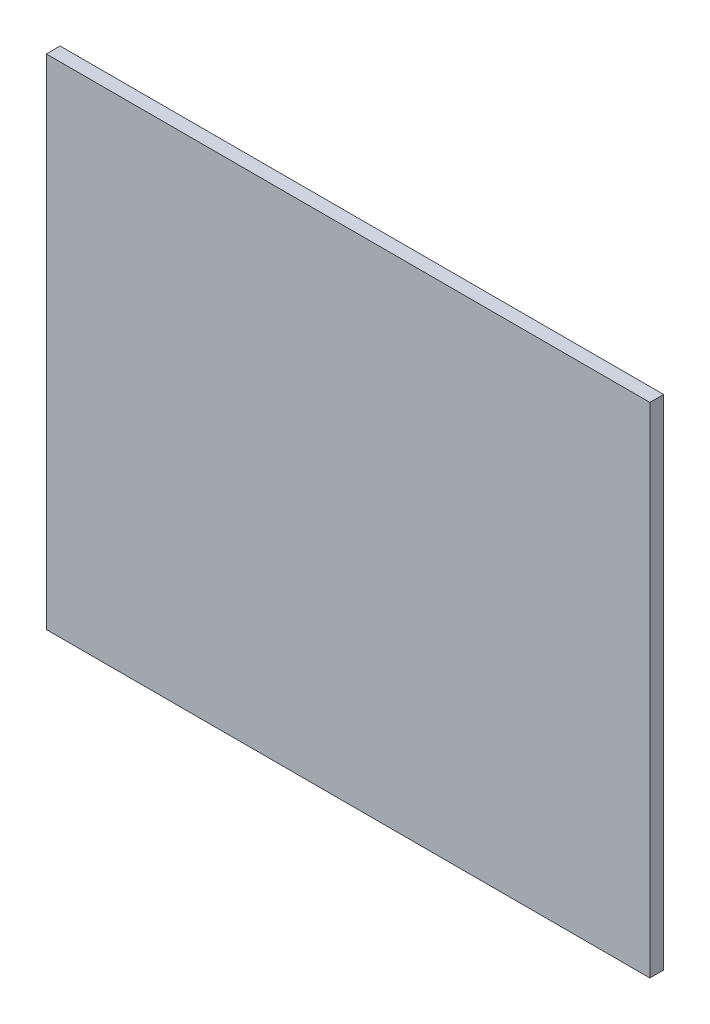
ISO-10303-21;
HEADER;
FILE_DESCRIPTION(('STEP AP214'),'2;1');
FILE_NAME('part.step','',(''),(''),'','','');
FILE_SCHEMA(('AUTOMOTIVE_DESIGN { 1 0 10303 214 1 1 1 1 }'));
ENDSEC;
DATA;
#1=APPLICATION_CONTEXT('core data for automotive mechanical design processes');
#2=APPLICATION_PROTOCOL_DEFINITION('international standard','automotive_design',2000,#1);
#3=PRODUCT_CONTEXT('',#1,'mechanical');
#4=PRODUCT('Part','Part','',(#3));
#5=PRODUCT_RELATED_PRODUCT_CATEGORY('part','',(#4));
#6=PRODUCT_DEFINITION_FORMATION('','',#4);
#7=PRODUCT_DEFINITION_CONTEXT('part definition',#1,'design');
#8=PRODUCT_DEFINITION('design','',#6,#7);
#9=PRODUCT_DEFINITION_SHAPE('','',#8);
#10=(LENGTH_UNIT() NAMED_UNIT(*) SI_UNIT(.MILLI.,.METRE.));
#11=(NAMED_UNIT(*) PLANE_ANGLE_UNIT() SI_UNIT($,.RADIAN.));
#12=(NAMED_UNIT(*) SI_UNIT($,.STERADIAN.) SOLID_ANGLE_UNIT());
#13=UNCERTAINTY_MEASURE_WITH_UNIT(LENGTH_MEASURE(1.E-05),#10,'distance_accuracy_value','');
#14=(GEOMETRIC_REPRESENTATION_CONTEXT(3) GLOBAL_UNCERTAINTY_ASSIGNED_CONTEXT((#13)) GLOBAL_UNIT_ASSIGNED_CONTEXT((#10,
#11,#12)) REPRESENTATION_CONTEXT('',''));
#15=CARTESIAN_POINT('',(0.,0.,0.));
#16=DIRECTION('',(0.,0.,1.));
#17=DIRECTION('',(1.,0.,0.));
#18=AXIS2_PLACEMENT_3D('',#15,#16,#17);
#19=CARTESIAN_POINT('',(-22.6728665212026,31.6329302665537,1.5875));
#20=DIRECTION('',(1.,0.,0.));
#21=DIRECTION('',(0.,1.,0.));
#22=AXIS2_PLACEMENT_3D('',#19,#20,#21);
#23=PLANE('',#22);
#24=DIRECTION('',(0.,-1.,0.));
#25=VECTOR('',#24,1.);
#26=CARTESIAN_POINT('',(-22.6728665212026,31.6329302665537,0.));
#27=LINE('',#26,#25);
#28=CARTESIAN_POINT('',(-22.6728665212026,31.6329302665537,0.));
#29=VERTEX_POINT('',#28);
#30=CARTESIAN_POINT('',(-22.6728665212026,-25.7710697334463,0.));
#31=VERTEX_POINT('',#30);
#32=EDGE_CURVE('E97',#29,#31,#27,.T.);
#33=ORIENTED_EDGE('',*,*,#32,.T.);
#34=DIRECTION('',(0.,0.,-1.));
#35=VECTOR('',#34,1.);
#36=CARTESIAN_POINT('',(-22.6728665212026,-25.7710697334463,1.5875));
#37=LINE('',#36,#35);
#38=CARTESIAN_POINT('',(-22.6728665212026,-25.7710697334463,1.5875));
#39=VERTEX_POINT('',#38);
#40=EDGE_CURVE('E11',#39,#31,#37,.T.);
#41=ORIENTED_EDGE('',*,*,#40,.F.);
#42=DIRECTION('',(0.,-1.,0.));
#43=VECTOR('',#42,1.);
#44=CARTESIAN_POINT('',(-22.6728665212026,31.6329302665537,1.5875));
#45=LINE('',#44,#43);
#46=CARTESIAN_POINT('',(-22.6728665212026,31.6329302665537,1.5875));
#47=VERTEX_POINT('',#46);
#48=EDGE_CURVE('E85',#47,#39,#45,.T.);
#49=ORIENTED_EDGE('',*,*,#48,.F.);
#50=DIRECTION('',(0.,0.,-1.));
#51=VECTOR('',#50,1.);
#52=CARTESIAN_POINT('',(-22.6728665212026,31.6329302665537,1.5875));
#53=LINE('',#52,#51);
#54=EDGE_CURVE('E93',#47,#29,#53,.T.);
#55=ORIENTED_EDGE('',*,*,#54,.T.);
#56=EDGE_LOOP('',(#33,#41,#49,#55));
#57=FACE_BOUND('',#56,.T.);
#58=ADVANCED_FACE('F34',(#57),#23,.F.);
#59=CARTESIAN_POINT('',(-22.6728665212026,-25.7710697334463,1.5875));
#60=DIRECTION('',(0.,1.,0.));
#61=DIRECTION('',(0.,0.,1.));
#62=AXIS2_PLACEMENT_3D('',#59,#60,#61);
#63=PLANE('',#62);
#64=DIRECTION('',(1.,0.,0.));
#65=VECTOR('',#64,1.);
#66=CARTESIAN_POINT('',(-22.6728665212026,-25.7710697334463,0.));
#67=LINE('',#66,#65);
#68=CARTESIAN_POINT('',(46.8271334787975,-25.7710697334463,0.));
#69=VERTEX_POINT('',#68);
#70=EDGE_CURVE('E89',#31,#69,#67,.T.);
#71=ORIENTED_EDGE('',*,*,#70,.T.);
#72=DIRECTION('',(0.,0.,-1.));
#73=VECTOR('',#72,1.);
#74=CARTESIAN_POINT('',(46.8271334787975,-25.7710697334463,1.5875));
#75=LINE('',#74,#73);
#76=CARTESIAN_POINT('',(46.8271334787975,-25.7710697334463,1.5875));
#77=VERTEX_POINT('',#76);
#78=EDGE_CURVE('E42',#77,#69,#75,.T.);
#79=ORIENTED_EDGE('',*,*,#78,.F.);
#80=DIRECTION('',(1.,0.,0.));
#81=VECTOR('',#80,1.);
#82=CARTESIAN_POINT('',(-22.6728665212026,-25.7710697334463,1.5875));
#83=LINE('',#82,#81);
#84=EDGE_CURVE('E80',#39,#77,#83,.T.);
#85=ORIENTED_EDGE('',*,*,#84,.F.);
#86=ORIENTED_EDGE('',*,*,#40,.T.);
#87=EDGE_LOOP('',(#71,#79,#85,#86));
#88=FACE_BOUND('',#87,.T.);
#89=ADVANCED_FACE('F88',(#88),#63,.F.);
#90=CARTESIAN_POINT('',(46.8271334787975,31.6329302665538,1.5875));
#91=DIRECTION('',(-1.,0.,0.));
#92=DIRECTION('',(0.,0.,1.));
#93=AXIS2_PLACEMENT_3D('',#90,#91,#92);
#94=PLANE('',#93);
#95=DIRECTION('',(0.,1.,0.));
#96=VECTOR('',#95,1.);
#97=CARTESIAN_POINT('',(46.8271334787975,31.6329302665538,0.));
#98=LINE('',#97,#96);
#99=CARTESIAN_POINT('',(46.8271334787975,31.6329302665538,0.));
#100=VERTEX_POINT('',#99);
#101=EDGE_CURVE('E67',#69,#100,#98,.T.);
#102=ORIENTED_EDGE('',*,*,#101,.T.);
#103=DIRECTION('',(0.,0.,-1.));
#104=VECTOR('',#103,1.);
#105=CARTESIAN_POINT('',(46.8271334787975,31.6329302665538,1.5875));
#106=LINE('',#105,#104);
#107=CARTESIAN_POINT('',(46.8271334787975,31.6329302665538,1.5875));
#108=VERTEX_POINT('',#107);
#109=EDGE_CURVE('E90',#108,#100,#106,.T.);
#110=ORIENTED_EDGE('',*,*,#109,.F.);
#111=DIRECTION('',(0.,1.,0.));
#112=VECTOR('',#111,1.);
#113=CARTESIAN_POINT('',(46.8271334787975,31.6329302665538,1.5875));
#114=LINE('',#113,#112);
#115=EDGE_CURVE('E83',#77,#108,#114,.T.);
#116=ORIENTED_EDGE('',*,*,#115,.F.);
#117=ORIENTED_EDGE('',*,*,#78,.T.);
#118=EDGE_LOOP('',(#102,#110,#116,#117));
#119=FACE_BOUND('',#118,.T.);
#120=ADVANCED_FACE('F91',(#119),#94,.F.);
#121=CARTESIAN_POINT('',(-22.6728665212026,31.6329302665537,1.5875));
#122=DIRECTION('',(0.,-1.,0.));
#123=DIRECTION('',(1.,0.,0.));
#124=AXIS2_PLACEMENT_3D('',#121,#122,#123);
#125=PLANE('',#124);
#126=DIRECTION('',(-1.,0.,0.));
#127=VECTOR('',#126,1.);
#128=CARTESIAN_POINT('',(-22.6728665212026,31.6329302665537,0.));
#129=LINE('',#128,#127);
#130=EDGE_CURVE('E73',#100,#29,#129,.T.);
#131=ORIENTED_EDGE('',*,*,#130,.T.);
#132=ORIENTED_EDGE('',*,*,#54,.F.);
#133=DIRECTION('',(-1.,0.,0.));
#134=VECTOR('',#133,1.);
#135=CARTESIAN_POINT('',(-22.6728665212026,31.6329302665537,1.5875));
#136=LINE('',#135,#134);
#137=EDGE_CURVE('E50',#108,#47,#136,.T.);
#138=ORIENTED_EDGE('',*,*,#137,.F.);
#139=ORIENTED_EDGE('',*,*,#109,.T.);
#140=EDGE_LOOP('',(#131,#132,#138,#139));
#141=FACE_BOUND('',#140,.T.);
#142=ADVANCED_FACE('F104',(#141),#125,.F.);
#143=CARTESIAN_POINT('',(0.,0.,1.5875));
#144=DIRECTION('',(0.,0.,1.));
#145=DIRECTION('',(1.,0.,0.));
#146=AXIS2_PLACEMENT_3D('',#143,#144,#145);
#147=PLANE('',#146);
#148=ORIENTED_EDGE('',*,*,#48,.T.);
#149=ORIENTED_EDGE('',*,*,#84,.T.);
#150=ORIENTED_EDGE('',*,*,#115,.T.);
#151=ORIENTED_EDGE('',*,*,#137,.T.);
#152=EDGE_LOOP('',(#148,#149,#150,#151));
#153=FACE_BOUND('',#152,.T.);
#154=ADVANCED_FACE('F81',(#153),#147,.T.);
#155=CARTESIAN_POINT('',(0.,0.,0.));
#156=DIRECTION('',(0.,0.,1.));
#157=DIRECTION('',(1.,0.,0.));
#158=AXIS2_PLACEMENT_3D('',#155,#156,#157);
#159=PLANE('',#158);
#160=ORIENTED_EDGE('',*,*,#32,.F.);
#161=ORIENTED_EDGE('',*,*,#130,.F.);
#162=ORIENTED_EDGE('',*,*,#101,.F.);
#163=ORIENTED_EDGE('',*,*,#70,.F.);
#164=EDGE_LOOP('',(#160,#161,#162,#163));
#165=FACE_BOUND('',#164,.T.);
#166=ADVANCED_FACE('F107',(#165),#159,.F.);
#167=CLOSED_SHELL('',(#58,#89,#120,#142,#154,#166));
#168=MANIFOLD_SOLID_BREP('B2',#167);
#169=ADVANCED_BREP_SHAPE_REPRESENTATION('',(#18,#168),#14);
#170=SHAPE_DEFINITION_REPRESENTATION(#9,#169);
ENDSEC;
END-ISO-10303-21;
